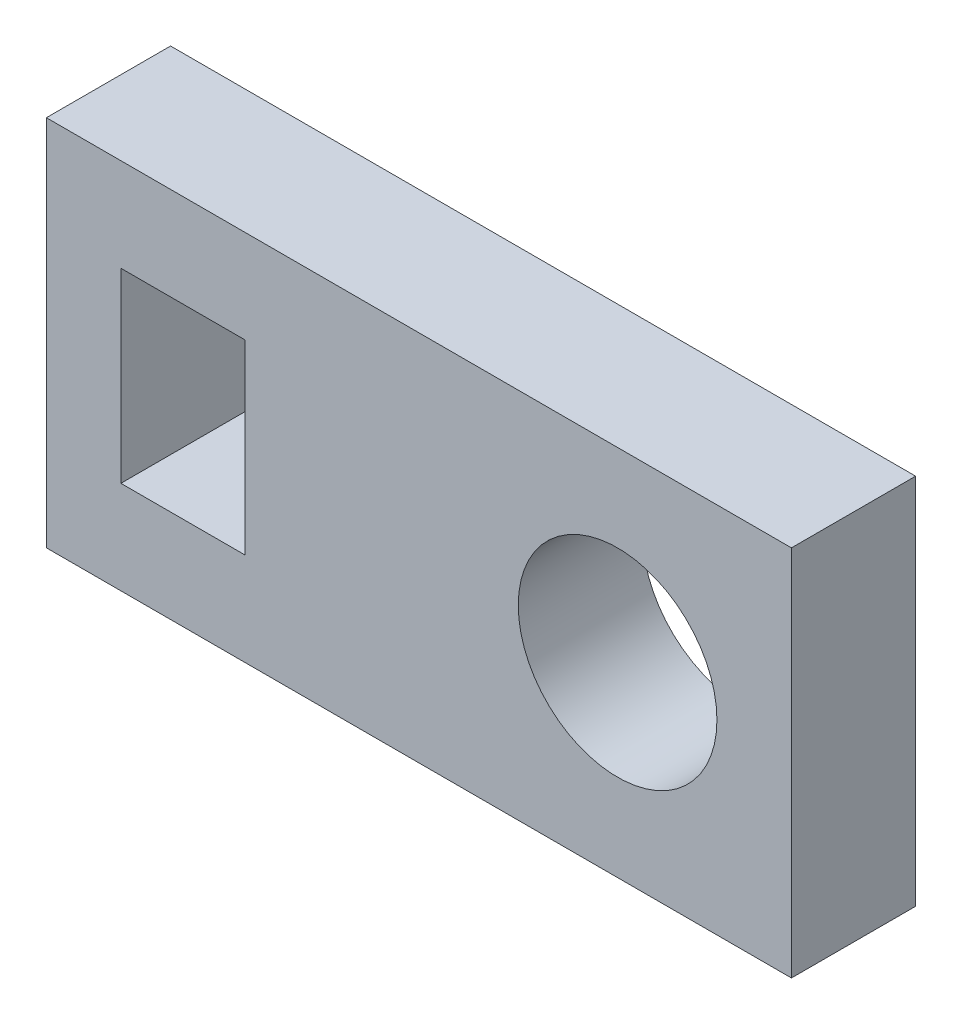
ISO-10303-21;
HEADER;
FILE_DESCRIPTION(('STEP AP214'),'2;1');
FILE_NAME('part.step','',(''),(''),'','','');
FILE_SCHEMA(('AUTOMOTIVE_DESIGN { 1 0 10303 214 1 1 1 1 }'));
ENDSEC;
DATA;
#1=APPLICATION_CONTEXT('core data for automotive mechanical design processes');
#2=APPLICATION_PROTOCOL_DEFINITION('international standard','automotive_design',2000,#1);
#3=PRODUCT_CONTEXT('',#1,'mechanical');
#4=PRODUCT('Part','Part','',(#3));
#5=PRODUCT_RELATED_PRODUCT_CATEGORY('part','',(#4));
#6=PRODUCT_DEFINITION_FORMATION('','',#4);
#7=PRODUCT_DEFINITION_CONTEXT('part definition',#1,'design');
#8=PRODUCT_DEFINITION('design','',#6,#7);
#9=PRODUCT_DEFINITION_SHAPE('','',#8);
#10=(LENGTH_UNIT() NAMED_UNIT(*) SI_UNIT(.MILLI.,.METRE.));
#11=(NAMED_UNIT(*) PLANE_ANGLE_UNIT() SI_UNIT($,.RADIAN.));
#12=(NAMED_UNIT(*) SI_UNIT($,.STERADIAN.) SOLID_ANGLE_UNIT());
#13=UNCERTAINTY_MEASURE_WITH_UNIT(LENGTH_MEASURE(1.E-05),#10,'distance_accuracy_value','');
#14=(GEOMETRIC_REPRESENTATION_CONTEXT(3) GLOBAL_UNCERTAINTY_ASSIGNED_CONTEXT((#13)) GLOBAL_UNIT_ASSIGNED_CONTEXT((#10,
#11,#12)) REPRESENTATION_CONTEXT('',''));
#15=CARTESIAN_POINT('',(0.,0.,0.));
#16=DIRECTION('',(0.,0.,1.));
#17=DIRECTION('',(1.,0.,0.));
#18=AXIS2_PLACEMENT_3D('',#15,#16,#17);
#19=CARTESIAN_POINT('',(0.,15.,5.));
#20=DIRECTION('',(0.,0.,-1.));
#21=DIRECTION('',(-1.,0.,0.));
#22=AXIS2_PLACEMENT_3D('',#19,#20,#21);
#23=PLANE('',#22);
#24=CARTESIAN_POINT('',(23.,7.5,5.));
#25=DIRECTION('',(0.,0.,1.));
#26=DIRECTION('',(1.,0.,0.));
#27=AXIS2_PLACEMENT_3D('',#24,#25,#26);
#28=CIRCLE('',#27,4.);
#29=CARTESIAN_POINT('',(27.,7.5,5.));
#30=VERTEX_POINT('',#29);
#31=EDGE_CURVE('E131',#30,#30,#28,.T.);
#32=ORIENTED_EDGE('',*,*,#31,.F.);
#33=EDGE_LOOP('',(#32));
#34=FACE_BOUND('',#33,.T.);
#35=DIRECTION('',(0.,-1.,0.));
#36=VECTOR('',#35,1.);
#37=CARTESIAN_POINT('',(0.,0.,5.));
#38=LINE('',#37,#36);
#39=CARTESIAN_POINT('',(0.,15.,5.));
#40=VERTEX_POINT('',#39);
#41=CARTESIAN_POINT('',(0.,0.,5.));
#42=VERTEX_POINT('',#41);
#43=EDGE_CURVE('E137',#40,#42,#38,.T.);
#44=ORIENTED_EDGE('',*,*,#43,.T.);
#45=DIRECTION('',(1.,0.,0.));
#46=VECTOR('',#45,1.);
#47=CARTESIAN_POINT('',(0.,0.,5.));
#48=LINE('',#47,#46);
#49=CARTESIAN_POINT('',(30.,0.,5.));
#50=VERTEX_POINT('',#49);
#51=EDGE_CURVE('E140',#42,#50,#48,.T.);
#52=ORIENTED_EDGE('',*,*,#51,.T.);
#53=DIRECTION('',(0.,1.,0.));
#54=VECTOR('',#53,1.);
#55=CARTESIAN_POINT('',(30.,0.,5.));
#56=LINE('',#55,#54);
#57=CARTESIAN_POINT('',(30.,15.,5.));
#58=VERTEX_POINT('',#57);
#59=EDGE_CURVE('E143',#50,#58,#56,.T.);
#60=ORIENTED_EDGE('',*,*,#59,.T.);
#61=DIRECTION('',(-1.,0.,0.));
#62=VECTOR('',#61,1.);
#63=CARTESIAN_POINT('',(0.,15.,5.));
#64=LINE('',#63,#62);
#65=EDGE_CURVE('E145',#58,#40,#64,.T.);
#66=ORIENTED_EDGE('',*,*,#65,.T.);
#67=EDGE_LOOP('',(#44,#52,#60,#66));
#68=FACE_BOUND('',#67,.T.);
#69=DIRECTION('',(0.,-1.,0.));
#70=VECTOR('',#69,1.);
#71=CARTESIAN_POINT('',(3.,11.25,5.));
#72=LINE('',#71,#70);
#73=CARTESIAN_POINT('',(3.,11.25,5.));
#74=VERTEX_POINT('',#73);
#75=CARTESIAN_POINT('',(3.,3.75,5.));
#76=VERTEX_POINT('',#75);
#77=EDGE_CURVE('E95',#74,#76,#72,.T.);
#78=ORIENTED_EDGE('',*,*,#77,.F.);
#79=DIRECTION('',(-1.,0.,0.));
#80=VECTOR('',#79,1.);
#81=CARTESIAN_POINT('',(3.,11.25,5.));
#82=LINE('',#81,#80);
#83=CARTESIAN_POINT('',(8.,11.25,5.));
#84=VERTEX_POINT('',#83);
#85=EDGE_CURVE('E117',#84,#74,#82,.T.);
#86=ORIENTED_EDGE('',*,*,#85,.F.);
#87=DIRECTION('',(0.,1.,0.));
#88=VECTOR('',#87,1.);
#89=CARTESIAN_POINT('',(8.,11.25,5.));
#90=LINE('',#89,#88);
#91=CARTESIAN_POINT('',(8.,3.75,5.));
#92=VERTEX_POINT('',#91);
#93=EDGE_CURVE('E115',#92,#84,#90,.T.);
#94=ORIENTED_EDGE('',*,*,#93,.F.);
#95=DIRECTION('',(1.,0.,0.));
#96=VECTOR('',#95,1.);
#97=CARTESIAN_POINT('',(3.,3.75,5.));
#98=LINE('',#97,#96);
#99=EDGE_CURVE('E103',#76,#92,#98,.T.);
#100=ORIENTED_EDGE('',*,*,#99,.F.);
#101=EDGE_LOOP('',(#78,#86,#94,#100));
#102=FACE_BOUND('',#101,.T.);
#103=ADVANCED_FACE('F30',(#34,#68,#102),#23,.F.);
#104=CARTESIAN_POINT('',(0.,15.,0.));
#105=DIRECTION('',(0.,0.,-1.));
#106=DIRECTION('',(-1.,0.,0.));
#107=AXIS2_PLACEMENT_3D('',#104,#105,#106);
#108=PLANE('',#107);
#109=CARTESIAN_POINT('',(23.,7.5,0.));
#110=DIRECTION('',(0.,0.,1.));
#111=DIRECTION('',(1.,0.,0.));
#112=AXIS2_PLACEMENT_3D('',#109,#110,#111);
#113=CIRCLE('',#112,4.);
#114=CARTESIAN_POINT('',(27.,7.5,0.));
#115=VERTEX_POINT('',#114);
#116=EDGE_CURVE('E111',#115,#115,#113,.T.);
#117=ORIENTED_EDGE('',*,*,#116,.T.);
#118=EDGE_LOOP('',(#117));
#119=FACE_BOUND('',#118,.T.);
#120=DIRECTION('',(0.,-1.,0.));
#121=VECTOR('',#120,1.);
#122=CARTESIAN_POINT('',(0.,0.,0.));
#123=LINE('',#122,#121);
#124=CARTESIAN_POINT('',(0.,15.,0.));
#125=VERTEX_POINT('',#124);
#126=CARTESIAN_POINT('',(0.,0.,0.));
#127=VERTEX_POINT('',#126);
#128=EDGE_CURVE('E134',#125,#127,#123,.T.);
#129=ORIENTED_EDGE('',*,*,#128,.F.);
#130=DIRECTION('',(-1.,0.,0.));
#131=VECTOR('',#130,1.);
#132=CARTESIAN_POINT('',(0.,15.,0.));
#133=LINE('',#132,#131);
#134=CARTESIAN_POINT('',(30.,15.,0.));
#135=VERTEX_POINT('',#134);
#136=EDGE_CURVE('E141',#135,#125,#133,.T.);
#137=ORIENTED_EDGE('',*,*,#136,.F.);
#138=DIRECTION('',(0.,1.,0.));
#139=VECTOR('',#138,1.);
#140=CARTESIAN_POINT('',(30.,0.,0.));
#141=LINE('',#140,#139);
#142=CARTESIAN_POINT('',(30.,0.,0.));
#143=VERTEX_POINT('',#142);
#144=EDGE_CURVE('E152',#143,#135,#141,.T.);
#145=ORIENTED_EDGE('',*,*,#144,.F.);
#146=DIRECTION('',(1.,0.,0.));
#147=VECTOR('',#146,1.);
#148=CARTESIAN_POINT('',(0.,0.,0.));
#149=LINE('',#148,#147);
#150=EDGE_CURVE('E150',#127,#143,#149,.T.);
#151=ORIENTED_EDGE('',*,*,#150,.F.);
#152=EDGE_LOOP('',(#129,#137,#145,#151));
#153=FACE_BOUND('',#152,.T.);
#154=DIRECTION('',(-1.,0.,0.));
#155=VECTOR('',#154,1.);
#156=CARTESIAN_POINT('',(3.,11.25,0.));
#157=LINE('',#156,#155);
#158=CARTESIAN_POINT('',(8.,11.25,0.));
#159=VERTEX_POINT('',#158);
#160=CARTESIAN_POINT('',(3.,11.25,0.));
#161=VERTEX_POINT('',#160);
#162=EDGE_CURVE('E104',#159,#161,#157,.T.);
#163=ORIENTED_EDGE('',*,*,#162,.T.);
#164=DIRECTION('',(0.,-1.,0.));
#165=VECTOR('',#164,1.);
#166=CARTESIAN_POINT('',(3.,11.25,0.));
#167=LINE('',#166,#165);
#168=CARTESIAN_POINT('',(3.,3.75,0.));
#169=VERTEX_POINT('',#168);
#170=EDGE_CURVE('E53',#161,#169,#167,.T.);
#171=ORIENTED_EDGE('',*,*,#170,.T.);
#172=DIRECTION('',(1.,0.,0.));
#173=VECTOR('',#172,1.);
#174=CARTESIAN_POINT('',(3.,3.75,0.));
#175=LINE('',#174,#173);
#176=CARTESIAN_POINT('',(8.,3.75,0.));
#177=VERTEX_POINT('',#176);
#178=EDGE_CURVE('E110',#169,#177,#175,.T.);
#179=ORIENTED_EDGE('',*,*,#178,.T.);
#180=DIRECTION('',(0.,1.,0.));
#181=VECTOR('',#180,1.);
#182=CARTESIAN_POINT('',(8.,11.25,0.));
#183=LINE('',#182,#181);
#184=EDGE_CURVE('E123',#177,#159,#183,.T.);
#185=ORIENTED_EDGE('',*,*,#184,.T.);
#186=EDGE_LOOP('',(#163,#171,#179,#185));
#187=FACE_BOUND('',#186,.T.);
#188=ADVANCED_FACE('F170',(#119,#153,#187),#108,.T.);
#189=CARTESIAN_POINT('',(0.,0.,5.));
#190=DIRECTION('',(1.,0.,0.));
#191=DIRECTION('',(0.,0.,-1.));
#192=AXIS2_PLACEMENT_3D('',#189,#190,#191);
#193=PLANE('',#192);
#194=ORIENTED_EDGE('',*,*,#128,.T.);
#195=DIRECTION('',(0.,0.,-1.));
#196=VECTOR('',#195,1.);
#197=CARTESIAN_POINT('',(0.,0.,5.));
#198=LINE('',#197,#196);
#199=EDGE_CURVE('E11',#42,#127,#198,.T.);
#200=ORIENTED_EDGE('',*,*,#199,.F.);
#201=ORIENTED_EDGE('',*,*,#43,.F.);
#202=DIRECTION('',(0.,0.,-1.));
#203=VECTOR('',#202,1.);
#204=CARTESIAN_POINT('',(0.,15.,5.));
#205=LINE('',#204,#203);
#206=EDGE_CURVE('E147',#40,#125,#205,.T.);
#207=ORIENTED_EDGE('',*,*,#206,.T.);
#208=EDGE_LOOP('',(#194,#200,#201,#207));
#209=FACE_BOUND('',#208,.T.);
#210=ADVANCED_FACE('F32',(#209),#193,.F.);
#211=CARTESIAN_POINT('',(0.,0.,5.));
#212=DIRECTION('',(0.,1.,0.));
#213=DIRECTION('',(0.,0.,1.));
#214=AXIS2_PLACEMENT_3D('',#211,#212,#213);
#215=PLANE('',#214);
#216=ORIENTED_EDGE('',*,*,#150,.T.);
#217=DIRECTION('',(0.,0.,-1.));
#218=VECTOR('',#217,1.);
#219=CARTESIAN_POINT('',(30.,0.,5.));
#220=LINE('',#219,#218);
#221=EDGE_CURVE('E38',#50,#143,#220,.T.);
#222=ORIENTED_EDGE('',*,*,#221,.F.);
#223=ORIENTED_EDGE('',*,*,#51,.F.);
#224=ORIENTED_EDGE('',*,*,#199,.T.);
#225=EDGE_LOOP('',(#216,#222,#223,#224));
#226=FACE_BOUND('',#225,.T.);
#227=ADVANCED_FACE('F180',(#226),#215,.F.);
#228=CARTESIAN_POINT('',(30.,0.,5.));
#229=DIRECTION('',(-1.,0.,0.));
#230=DIRECTION('',(0.,0.,1.));
#231=AXIS2_PLACEMENT_3D('',#228,#229,#230);
#232=PLANE('',#231);
#233=ORIENTED_EDGE('',*,*,#144,.T.);
#234=DIRECTION('',(0.,0.,-1.));
#235=VECTOR('',#234,1.);
#236=CARTESIAN_POINT('',(30.,15.,5.));
#237=LINE('',#236,#235);
#238=EDGE_CURVE('E157',#58,#135,#237,.T.);
#239=ORIENTED_EDGE('',*,*,#238,.F.);
#240=ORIENTED_EDGE('',*,*,#59,.F.);
#241=ORIENTED_EDGE('',*,*,#221,.T.);
#242=EDGE_LOOP('',(#233,#239,#240,#241));
#243=FACE_BOUND('',#242,.T.);
#244=ADVANCED_FACE('F164',(#243),#232,.F.);
#245=CARTESIAN_POINT('',(0.,15.,5.));
#246=DIRECTION('',(0.,-1.,0.));
#247=DIRECTION('',(0.,0.,-1.));
#248=AXIS2_PLACEMENT_3D('',#245,#246,#247);
#249=PLANE('',#248);
#250=ORIENTED_EDGE('',*,*,#136,.T.);
#251=ORIENTED_EDGE('',*,*,#206,.F.);
#252=ORIENTED_EDGE('',*,*,#65,.F.);
#253=ORIENTED_EDGE('',*,*,#238,.T.);
#254=EDGE_LOOP('',(#250,#251,#252,#253));
#255=FACE_BOUND('',#254,.T.);
#256=ADVANCED_FACE('F174',(#255),#249,.F.);
#257=CARTESIAN_POINT('',(23.,7.5,5.));
#258=DIRECTION('',(0.,0.,-1.));
#259=DIRECTION('',(-1.,0.,0.));
#260=AXIS2_PLACEMENT_3D('',#257,#258,#259);
#261=CYLINDRICAL_SURFACE('',#260,4.);
#262=ORIENTED_EDGE('',*,*,#31,.T.);
#263=EDGE_LOOP('',(#262));
#264=FACE_BOUND('',#263,.T.);
#265=ORIENTED_EDGE('',*,*,#116,.F.);
#266=EDGE_LOOP('',(#265));
#267=FACE_BOUND('',#266,.T.);
#268=ADVANCED_FACE('F197',(#264,#267),#261,.F.);
#269=CARTESIAN_POINT('',(3.,11.25,5.));
#270=DIRECTION('',(1.,0.,0.));
#271=DIRECTION('',(0.,0.,-1.));
#272=AXIS2_PLACEMENT_3D('',#269,#270,#271);
#273=PLANE('',#272);
#274=ORIENTED_EDGE('',*,*,#170,.F.);
#275=DIRECTION('',(0.,0.,-1.));
#276=VECTOR('',#275,1.);
#277=CARTESIAN_POINT('',(3.,11.25,5.));
#278=LINE('',#277,#276);
#279=EDGE_CURVE('E99',#74,#161,#278,.T.);
#280=ORIENTED_EDGE('',*,*,#279,.F.);
#281=ORIENTED_EDGE('',*,*,#77,.T.);
#282=DIRECTION('',(0.,0.,-1.));
#283=VECTOR('',#282,1.);
#284=CARTESIAN_POINT('',(3.,3.75,5.));
#285=LINE('',#284,#283);
#286=EDGE_CURVE('E98',#76,#169,#285,.T.);
#287=ORIENTED_EDGE('',*,*,#286,.T.);
#288=EDGE_LOOP('',(#274,#280,#281,#287));
#289=FACE_BOUND('',#288,.T.);
#290=ADVANCED_FACE('F97',(#289),#273,.T.);
#291=CARTESIAN_POINT('',(3.,3.75,5.));
#292=DIRECTION('',(0.,1.,0.));
#293=DIRECTION('',(0.,0.,1.));
#294=AXIS2_PLACEMENT_3D('',#291,#292,#293);
#295=PLANE('',#294);
#296=ORIENTED_EDGE('',*,*,#178,.F.);
#297=ORIENTED_EDGE('',*,*,#286,.F.);
#298=ORIENTED_EDGE('',*,*,#99,.T.);
#299=DIRECTION('',(0.,0.,-1.));
#300=VECTOR('',#299,1.);
#301=CARTESIAN_POINT('',(8.,3.75,5.));
#302=LINE('',#301,#300);
#303=EDGE_CURVE('E112',#92,#177,#302,.T.);
#304=ORIENTED_EDGE('',*,*,#303,.T.);
#305=EDGE_LOOP('',(#296,#297,#298,#304));
#306=FACE_BOUND('',#305,.T.);
#307=ADVANCED_FACE('F107',(#306),#295,.T.);
#308=CARTESIAN_POINT('',(8.,11.25,5.));
#309=DIRECTION('',(-1.,0.,0.));
#310=DIRECTION('',(0.,0.,1.));
#311=AXIS2_PLACEMENT_3D('',#308,#309,#310);
#312=PLANE('',#311);
#313=ORIENTED_EDGE('',*,*,#184,.F.);
#314=ORIENTED_EDGE('',*,*,#303,.F.);
#315=ORIENTED_EDGE('',*,*,#93,.T.);
#316=DIRECTION('',(0.,0.,-1.));
#317=VECTOR('',#316,1.);
#318=CARTESIAN_POINT('',(8.,11.25,5.));
#319=LINE('',#318,#317);
#320=EDGE_CURVE('E45',#84,#159,#319,.T.);
#321=ORIENTED_EDGE('',*,*,#320,.T.);
#322=EDGE_LOOP('',(#313,#314,#315,#321));
#323=FACE_BOUND('',#322,.T.);
#324=ADVANCED_FACE('F213',(#323),#312,.T.);
#325=CARTESIAN_POINT('',(3.,11.25,5.));
#326=DIRECTION('',(0.,-1.,0.));
#327=DIRECTION('',(0.,0.,-1.));
#328=AXIS2_PLACEMENT_3D('',#325,#326,#327);
#329=PLANE('',#328);
#330=ORIENTED_EDGE('',*,*,#162,.F.);
#331=ORIENTED_EDGE('',*,*,#320,.F.);
#332=ORIENTED_EDGE('',*,*,#85,.T.);
#333=ORIENTED_EDGE('',*,*,#279,.T.);
#334=EDGE_LOOP('',(#330,#331,#332,#333));
#335=FACE_BOUND('',#334,.T.);
#336=ADVANCED_FACE('F218',(#335),#329,.T.);
#337=CLOSED_SHELL('',(#103,#188,#210,#227,#244,#256,#268,#290,#307,#324,#336));
#338=MANIFOLD_SOLID_BREP('B2',#337);
#339=ADVANCED_BREP_SHAPE_REPRESENTATION('',(#18,#338),#14);
#340=SHAPE_DEFINITION_REPRESENTATION(#9,#339);
ENDSEC;
END-ISO-10303-21;
